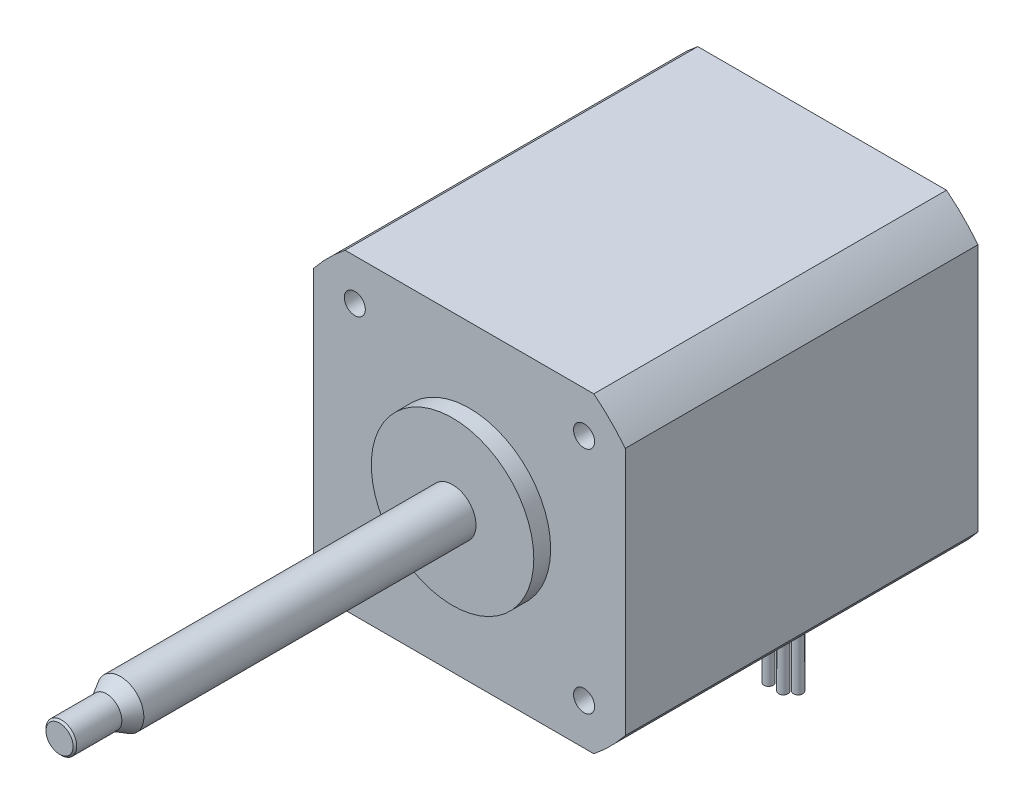
ISO-10303-21;
HEADER;
FILE_DESCRIPTION(('STEP AP214'),'2;1');
FILE_NAME('part.step','',(''),(''),'','','');
FILE_SCHEMA(('AUTOMOTIVE_DESIGN { 1 0 10303 214 1 1 1 1 }'));
ENDSEC;
DATA;
#1=APPLICATION_CONTEXT('core data for automotive mechanical design processes');
#2=APPLICATION_PROTOCOL_DEFINITION('international standard','automotive_design',2000,#1);
#3=PRODUCT_CONTEXT('',#1,'mechanical');
#4=PRODUCT('Part','Part','',(#3));
#5=PRODUCT_RELATED_PRODUCT_CATEGORY('part','',(#4));
#6=PRODUCT_DEFINITION_FORMATION('','',#4);
#7=PRODUCT_DEFINITION_CONTEXT('part definition',#1,'design');
#8=PRODUCT_DEFINITION('design','',#6,#7);
#9=PRODUCT_DEFINITION_SHAPE('','',#8);
#10=(LENGTH_UNIT() NAMED_UNIT(*) SI_UNIT(.MILLI.,.METRE.));
#11=(NAMED_UNIT(*) PLANE_ANGLE_UNIT() SI_UNIT($,.RADIAN.));
#12=(NAMED_UNIT(*) SI_UNIT($,.STERADIAN.) SOLID_ANGLE_UNIT());
#13=UNCERTAINTY_MEASURE_WITH_UNIT(LENGTH_MEASURE(1.E-05),#10,'distance_accuracy_value','');
#14=(GEOMETRIC_REPRESENTATION_CONTEXT(3) GLOBAL_UNCERTAINTY_ASSIGNED_CONTEXT((#13)) GLOBAL_UNIT_ASSIGNED_CONTEXT((#10,
#11,#12)) REPRESENTATION_CONTEXT('',''));
#15=CARTESIAN_POINT('',(0.,0.,0.));
#16=DIRECTION('',(0.,0.,1.));
#17=DIRECTION('',(1.,0.,0.));
#18=AXIS2_PLACEMENT_3D('',#15,#16,#17);
#19=CARTESIAN_POINT('',(0.,0.,55.2419509131439));
#20=DIRECTION('',(0.,0.,-0.999999999999995));
#21=DIRECTION('',(-0.421543260999066,0.906808292367399,0.));
#22=AXIS2_PLACEMENT_3D('',#19,#20,#21);
#23=CONICAL_SURFACE('',#22,2.0828,0.785398163397428);
#24=CARTESIAN_POINT('',(0.,0.,55.4919509131439));
#25=DIRECTION('',(0.,0.,-0.999999999999995));
#26=DIRECTION('',(-0.421543260999066,0.906808292367399,0.));
#27=AXIS2_PLACEMENT_3D('',#24,#25,#26);
#28=CIRCLE('',#27,1.8328);
#29=CARTESIAN_POINT('',(-0.772604488759085,1.66199823825096,55.4919509131439));
#30=VERTEX_POINT('',#29);
#31=EDGE_CURVE('E299',#30,#30,#28,.T.);
#32=ORIENTED_EDGE('',*,*,#31,.T.);
#33=EDGE_LOOP('',(#32));
#34=FACE_BOUND('',#33,.T.);
#35=CARTESIAN_POINT('',(0.,0.,55.2419509131439));
#36=DIRECTION('',(0.,0.,-0.999999999999995));
#37=DIRECTION('',(-0.421543260999066,0.906808292367399,0.));
#38=AXIS2_PLACEMENT_3D('',#35,#36,#37);
#39=CIRCLE('',#38,2.0828);
#40=CARTESIAN_POINT('',(-0.877990304008853,1.88870031134282,55.2419509131439));
#41=VERTEX_POINT('',#40);
#42=EDGE_CURVE('E25',#41,#41,#39,.T.);
#43=ORIENTED_EDGE('',*,*,#42,.F.);
#44=EDGE_LOOP('',(#43));
#45=FACE_BOUND('',#44,.T.);
#46=ADVANCED_FACE('F16',(#34,#45),#23,.T.);
#47=CARTESIAN_POINT('',(0.,0.,55.4919509131439));
#48=DIRECTION('',(0.,0.,-0.999999999999995));
#49=DIRECTION('',(-0.421543260999066,0.906808292367399,0.));
#50=AXIS2_PLACEMENT_3D('',#47,#48,#49);
#51=CYLINDRICAL_SURFACE('',#50,2.0828);
#52=ORIENTED_EDGE('',*,*,#42,.T.);
#53=EDGE_LOOP('',(#52));
#54=FACE_BOUND('',#53,.T.);
#55=CARTESIAN_POINT('',(0.,0.,49.1419509131439));
#56=DIRECTION('',(0.,0.,-0.999999999999995));
#57=DIRECTION('',(-0.421543260999066,0.906808292367399,0.));
#58=AXIS2_PLACEMENT_3D('',#55,#56,#57);
#59=CIRCLE('',#58,2.0828);
#60=CARTESIAN_POINT('',(-0.877990304008853,1.88870031134282,49.1419509131439));
#61=VERTEX_POINT('',#60);
#62=EDGE_CURVE('E315',#61,#61,#59,.T.);
#63=ORIENTED_EDGE('',*,*,#62,.F.);
#64=EDGE_LOOP('',(#63));
#65=FACE_BOUND('',#64,.T.);
#66=ADVANCED_FACE('F324',(#54,#65),#51,.T.);
#67=CARTESIAN_POINT('',(0.,0.,47.2502050211172));
#68=DIRECTION('',(0.,0.,-0.999999999999995));
#69=DIRECTION('',(-0.421543260999066,0.906808292367399,0.));
#70=AXIS2_PLACEMENT_3D('',#67,#68,#69);
#71=CONICAL_SURFACE('',#70,3.175,0.523598775598295);
#72=ORIENTED_EDGE('',*,*,#62,.T.);
#73=EDGE_LOOP('',(#72));
#74=FACE_BOUND('',#73,.T.);
#75=CARTESIAN_POINT('',(0.,0.,47.2502050211172));
#76=DIRECTION('',(0.,0.,-0.999999999999995));
#77=DIRECTION('',(-0.421543260999066,0.906808292367399,0.));
#78=AXIS2_PLACEMENT_3D('',#75,#76,#77);
#79=CIRCLE('',#78,3.175);
#80=CARTESIAN_POINT('',(-1.33839985367203,2.87911632826649,47.2502050211172));
#81=VERTEX_POINT('',#80);
#82=EDGE_CURVE('E311',#81,#81,#79,.T.);
#83=ORIENTED_EDGE('',*,*,#82,.F.);
#84=EDGE_LOOP('',(#83));
#85=FACE_BOUND('',#84,.T.);
#86=ADVANCED_FACE('F332',(#74,#85),#71,.T.);
#87=CARTESIAN_POINT('',(0.,0.,55.4919509131439));
#88=DIRECTION('',(0.,0.,-0.999999999999995));
#89=DIRECTION('',(-0.421543260999066,0.906808292367399,0.));
#90=AXIS2_PLACEMENT_3D('',#87,#88,#89);
#91=CYLINDRICAL_SURFACE('',#90,3.17500000000001);
#92=CARTESIAN_POINT('',(0.,0.,2.286));
#93=DIRECTION('',(0.,0.,1.));
#94=DIRECTION('',(1.,0.,0.));
#95=AXIS2_PLACEMENT_3D('',#92,#93,#94);
#96=CIRCLE('',#95,3.17500000000001);
#97=CARTESIAN_POINT('',(3.17500000000001,0.,2.286));
#98=VERTEX_POINT('',#97);
#99=EDGE_CURVE('E11',#98,#98,#96,.F.);
#100=ORIENTED_EDGE('',*,*,#99,.F.);
#101=EDGE_LOOP('',(#100));
#102=FACE_BOUND('',#101,.T.);
#103=ORIENTED_EDGE('',*,*,#82,.T.);
#104=EDGE_LOOP('',(#103));
#105=FACE_BOUND('',#104,.T.);
#106=ADVANCED_FACE('F337',(#102,#105),#91,.T.);
#107=CARTESIAN_POINT('',(0.772604488759085,-1.66199823825096,55.4919509131439));
#108=DIRECTION('',(0.,0.,0.999999999999995));
#109=DIRECTION('',(0.421543260999066,-0.906808292367399,0.));
#110=AXIS2_PLACEMENT_3D('',#107,#108,#109);
#111=PLANE('',#110);
#112=ORIENTED_EDGE('',*,*,#31,.F.);
#113=EDGE_LOOP('',(#112));
#114=FACE_BOUND('',#113,.T.);
#115=ADVANCED_FACE('F335',(#114),#111,.T.);
#116=CARTESIAN_POINT('',(-2.25,-17.925,-40.75));
#117=DIRECTION('',(0.,1.,0.));
#118=DIRECTION('',(0.,0.,1.));
#119=AXIS2_PLACEMENT_3D('',#116,#117,#118);
#120=PLANE('',#119);
#121=DIRECTION('',(0.,0.,-1.));
#122=VECTOR('',#121,1.);
#123=CARTESIAN_POINT('',(-2.25,-17.925,-44.25));
#124=LINE('',#123,#122);
#125=CARTESIAN_POINT('',(-2.25,-17.925,-40.75));
#126=VERTEX_POINT('',#125);
#127=CARTESIAN_POINT('',(-2.25,-17.925,-44.25));
#128=VERTEX_POINT('',#127);
#129=EDGE_CURVE('E136',#126,#128,#124,.T.);
#130=ORIENTED_EDGE('',*,*,#129,.T.);
#131=DIRECTION('',(1.,0.,0.));
#132=VECTOR('',#131,1.);
#133=CARTESIAN_POINT('',(-2.25,-17.925,-44.25));
#134=LINE('',#133,#132);
#135=CARTESIAN_POINT('',(2.25,-17.925,-44.25));
#136=VERTEX_POINT('',#135);
#137=EDGE_CURVE('E146',#128,#136,#134,.T.);
#138=ORIENTED_EDGE('',*,*,#137,.T.);
#139=DIRECTION('',(0.,0.,1.));
#140=VECTOR('',#139,1.);
#141=CARTESIAN_POINT('',(2.25,-17.925,-44.25));
#142=LINE('',#141,#140);
#143=CARTESIAN_POINT('',(2.25,-17.925,-40.75));
#144=VERTEX_POINT('',#143);
#145=EDGE_CURVE('E152',#136,#144,#142,.T.);
#146=ORIENTED_EDGE('',*,*,#145,.T.);
#147=DIRECTION('',(-1.,0.,0.));
#148=VECTOR('',#147,1.);
#149=CARTESIAN_POINT('',(-2.25,-17.925,-40.75));
#150=LINE('',#149,#148);
#151=EDGE_CURVE('E143',#144,#126,#150,.T.);
#152=ORIENTED_EDGE('',*,*,#151,.T.);
#153=EDGE_LOOP('',(#130,#138,#146,#152));
#154=FACE_BOUND('',#153,.T.);
#155=CARTESIAN_POINT('',(-1.5,-17.925,-42.));
#156=DIRECTION('',(0.,1.,0.));
#157=DIRECTION('',(0.,0.,1.));
#158=AXIS2_PLACEMENT_3D('',#155,#156,#157);
#159=CIRCLE('',#158,0.634999999999999);
#160=CARTESIAN_POINT('',(-1.5,-17.925,-41.365));
#161=VERTEX_POINT('',#160);
#162=EDGE_CURVE('E283',#161,#161,#159,.F.);
#163=ORIENTED_EDGE('',*,*,#162,.F.);
#164=EDGE_LOOP('',(#163));
#165=FACE_BOUND('',#164,.T.);
#166=CARTESIAN_POINT('',(0.500000000000003,-17.925,-42.));
#167=DIRECTION('',(0.,1.,0.));
#168=DIRECTION('',(0.,0.,1.));
#169=AXIS2_PLACEMENT_3D('',#166,#167,#168);
#170=CIRCLE('',#169,0.634999999999999);
#171=CARTESIAN_POINT('',(0.500000000000003,-17.925,-41.365));
#172=VERTEX_POINT('',#171);
#173=EDGE_CURVE('E287',#172,#172,#170,.F.);
#174=ORIENTED_EDGE('',*,*,#173,.F.);
#175=EDGE_LOOP('',(#174));
#176=FACE_BOUND('',#175,.T.);
#177=CARTESIAN_POINT('',(-0.499999999999996,-17.925,-43.));
#178=DIRECTION('',(0.,1.,0.));
#179=DIRECTION('',(0.,0.,1.));
#180=AXIS2_PLACEMENT_3D('',#177,#178,#179);
#181=CIRCLE('',#180,0.634999999999998);
#182=CARTESIAN_POINT('',(-0.499999999999996,-17.925,-42.365));
#183=VERTEX_POINT('',#182);
#184=EDGE_CURVE('E291',#183,#183,#181,.F.);
#185=ORIENTED_EDGE('',*,*,#184,.F.);
#186=EDGE_LOOP('',(#185));
#187=FACE_BOUND('',#186,.T.);
#188=CARTESIAN_POINT('',(1.5,-17.925,-43.));
#189=DIRECTION('',(0.,1.,0.));
#190=DIRECTION('',(0.,0.,1.));
#191=AXIS2_PLACEMENT_3D('',#188,#189,#190);
#192=CIRCLE('',#191,0.634999999999998);
#193=CARTESIAN_POINT('',(1.5,-17.925,-42.365));
#194=VERTEX_POINT('',#193);
#195=EDGE_CURVE('E295',#194,#194,#192,.F.);
#196=ORIENTED_EDGE('',*,*,#195,.F.);
#197=EDGE_LOOP('',(#196));
#198=FACE_BOUND('',#197,.T.);
#199=ADVANCED_FACE('F154',(#154,#165,#176,#187,#198),#120,.F.);
#200=CARTESIAN_POINT('',(-21.1,-21.1,0.));
#201=DIRECTION('',(0.,0.,1.));
#202=DIRECTION('',(1.,0.,0.));
#203=AXIS2_PLACEMENT_3D('',#200,#201,#202);
#204=PLANE('',#203);
#205=CARTESIAN_POINT('',(-15.52,-15.52,0.));
#206=DIRECTION('',(0.,0.,1.));
#207=DIRECTION('',(1.,0.,0.));
#208=AXIS2_PLACEMENT_3D('',#205,#206,#207);
#209=CIRCLE('',#208,1.4224);
#210=CARTESIAN_POINT('',(-14.0976,-15.52,0.));
#211=VERTEX_POINT('',#210);
#212=EDGE_CURVE('E840',#211,#211,#209,.T.);
#213=ORIENTED_EDGE('',*,*,#212,.F.);
#214=EDGE_LOOP('',(#213));
#215=FACE_BOUND('',#214,.T.);
#216=CARTESIAN_POINT('',(15.52,-15.52,0.));
#217=DIRECTION('',(0.,0.,1.));
#218=DIRECTION('',(1.,0.,0.));
#219=AXIS2_PLACEMENT_3D('',#216,#217,#218);
#220=CIRCLE('',#219,1.4224);
#221=CARTESIAN_POINT('',(16.9424,-15.52,0.));
#222=VERTEX_POINT('',#221);
#223=EDGE_CURVE('E847',#222,#222,#220,.T.);
#224=ORIENTED_EDGE('',*,*,#223,.F.);
#225=EDGE_LOOP('',(#224));
#226=FACE_BOUND('',#225,.T.);
#227=CARTESIAN_POINT('',(15.52,15.52,0.));
#228=DIRECTION('',(0.,0.,1.));
#229=DIRECTION('',(1.,0.,0.));
#230=AXIS2_PLACEMENT_3D('',#227,#228,#229);
#231=CIRCLE('',#230,1.4224);
#232=CARTESIAN_POINT('',(16.9424,15.52,0.));
#233=VERTEX_POINT('',#232);
#234=EDGE_CURVE('E766',#233,#233,#231,.T.);
#235=ORIENTED_EDGE('',*,*,#234,.F.);
#236=EDGE_LOOP('',(#235));
#237=FACE_BOUND('',#236,.T.);
#238=CARTESIAN_POINT('',(-15.52,15.52,0.));
#239=DIRECTION('',(0.,0.,1.));
#240=DIRECTION('',(1.,0.,0.));
#241=AXIS2_PLACEMENT_3D('',#238,#239,#240);
#242=CIRCLE('',#241,1.4224);
#243=CARTESIAN_POINT('',(-14.0976,15.52,0.));
#244=VERTEX_POINT('',#243);
#245=EDGE_CURVE('E754',#244,#244,#242,.T.);
#246=ORIENTED_EDGE('',*,*,#245,.F.);
#247=EDGE_LOOP('',(#246));
#248=FACE_BOUND('',#247,.T.);
#249=CARTESIAN_POINT('',(-0.113980167868195,-0.113980167868181,0.));
#250=DIRECTION('',(0.,0.,-1.));
#251=DIRECTION('',(-1.,0.,0.));
#252=AXIS2_PLACEMENT_3D('',#249,#250,#251);
#253=CIRCLE('',#252,26.8351);
#254=CARTESIAN_POINT('',(-16.8385,-21.1,0.));
#255=VERTEX_POINT('',#254);
#256=CARTESIAN_POINT('',(-21.1,-16.8385,0.));
#257=VERTEX_POINT('',#256);
#258=EDGE_CURVE('E200',#255,#257,#253,.T.);
#259=ORIENTED_EDGE('',*,*,#258,.F.);
#260=DIRECTION('',(1.,0.,0.));
#261=VECTOR('',#260,1.);
#262=CARTESIAN_POINT('',(-21.1,-21.1,0.));
#263=LINE('',#262,#261);
#264=CARTESIAN_POINT('',(16.8385,-21.1,0.));
#265=VERTEX_POINT('',#264);
#266=EDGE_CURVE('E259',#255,#265,#263,.T.);
#267=ORIENTED_EDGE('',*,*,#266,.T.);
#268=CARTESIAN_POINT('',(0.113980167868195,-0.113980167868181,0.));
#269=DIRECTION('',(0.,0.,-1.));
#270=DIRECTION('',(1.,0.,0.));
#271=AXIS2_PLACEMENT_3D('',#268,#269,#270);
#272=CIRCLE('',#271,26.8351);
#273=CARTESIAN_POINT('',(21.1,-16.8385,0.));
#274=VERTEX_POINT('',#273);
#275=EDGE_CURVE('E210',#274,#265,#272,.T.);
#276=ORIENTED_EDGE('',*,*,#275,.F.);
#277=DIRECTION('',(0.,1.,0.));
#278=VECTOR('',#277,1.);
#279=CARTESIAN_POINT('',(21.1,21.1,0.));
#280=LINE('',#279,#278);
#281=CARTESIAN_POINT('',(21.1,16.8385,0.));
#282=VERTEX_POINT('',#281);
#283=EDGE_CURVE('E262',#274,#282,#280,.T.);
#284=ORIENTED_EDGE('',*,*,#283,.T.);
#285=CARTESIAN_POINT('',(0.113980167868195,0.113980167868181,0.));
#286=DIRECTION('',(0.,0.,-1.));
#287=DIRECTION('',(-1.,0.,0.));
#288=AXIS2_PLACEMENT_3D('',#285,#286,#287);
#289=CIRCLE('',#288,26.8351);
#290=CARTESIAN_POINT('',(16.8385,21.1,0.));
#291=VERTEX_POINT('',#290);
#292=EDGE_CURVE('E238',#291,#282,#289,.T.);
#293=ORIENTED_EDGE('',*,*,#292,.F.);
#294=DIRECTION('',(-1.,0.,0.));
#295=VECTOR('',#294,1.);
#296=CARTESIAN_POINT('',(-21.1,21.1,0.));
#297=LINE('',#296,#295);
#298=CARTESIAN_POINT('',(-16.8385,21.1,0.));
#299=VERTEX_POINT('',#298);
#300=EDGE_CURVE('E265',#291,#299,#297,.T.);
#301=ORIENTED_EDGE('',*,*,#300,.T.);
#302=CARTESIAN_POINT('',(-0.113980167868195,0.113980167868181,0.));
#303=DIRECTION('',(0.,0.,-1.));
#304=DIRECTION('',(1.,0.,0.));
#305=AXIS2_PLACEMENT_3D('',#302,#303,#304);
#306=CIRCLE('',#305,26.8351);
#307=CARTESIAN_POINT('',(-21.1,16.8385,0.));
#308=VERTEX_POINT('',#307);
#309=EDGE_CURVE('E224',#308,#299,#306,.T.);
#310=ORIENTED_EDGE('',*,*,#309,.F.);
#311=DIRECTION('',(0.,-1.,0.));
#312=VECTOR('',#311,1.);
#313=CARTESIAN_POINT('',(-21.1,21.1,0.));
#314=LINE('',#313,#312);
#315=EDGE_CURVE('E253',#308,#257,#314,.T.);
#316=ORIENTED_EDGE('',*,*,#315,.T.);
#317=EDGE_LOOP('',(#259,#267,#276,#284,#293,#301,#310,#316));
#318=FACE_BOUND('',#317,.T.);
#319=CARTESIAN_POINT('',(0.,0.,0.));
#320=DIRECTION('',(0.,0.,1.));
#321=DIRECTION('',(1.,0.,0.));
#322=AXIS2_PLACEMENT_3D('',#319,#320,#321);
#323=CIRCLE('',#322,10.9982);
#324=CARTESIAN_POINT('',(10.9982,0.,0.));
#325=VERTEX_POINT('',#324);
#326=EDGE_CURVE('E187',#325,#325,#323,.T.);
#327=ORIENTED_EDGE('',*,*,#326,.F.);
#328=EDGE_LOOP('',(#327));
#329=FACE_BOUND('',#328,.T.);
#330=ADVANCED_FACE('F342',(#215,#226,#237,#248,#318,#329),#204,.T.);
#331=CARTESIAN_POINT('',(-21.1,21.1,-47.75));
#332=DIRECTION('',(-1.,0.,0.));
#333=DIRECTION('',(0.,-1.,0.));
#334=AXIS2_PLACEMENT_3D('',#331,#332,#333);
#335=PLANE('',#334);
#336=DIRECTION('',(0.,0.,1.));
#337=VECTOR('',#336,1.);
#338=CARTESIAN_POINT('',(-21.1,-16.8385,-47.75));
#339=LINE('',#338,#337);
#340=CARTESIAN_POINT('',(-21.1,-16.8385,-47.75));
#341=VERTEX_POINT('',#340);
#342=EDGE_CURVE('E207',#341,#257,#339,.T.);
#343=ORIENTED_EDGE('',*,*,#342,.T.);
#344=ORIENTED_EDGE('',*,*,#315,.F.);
#345=DIRECTION('',(0.,0.,1.));
#346=VECTOR('',#345,1.);
#347=CARTESIAN_POINT('',(-21.1,16.8385,-47.75));
#348=LINE('',#347,#346);
#349=CARTESIAN_POINT('',(-21.1,16.8385,-47.75));
#350=VERTEX_POINT('',#349);
#351=EDGE_CURVE('E235',#350,#308,#348,.T.);
#352=ORIENTED_EDGE('',*,*,#351,.F.);
#353=DIRECTION('',(0.,-1.,0.));
#354=VECTOR('',#353,1.);
#355=CARTESIAN_POINT('',(-21.1,21.1,-47.75));
#356=LINE('',#355,#354);
#357=EDGE_CURVE('E269',#350,#341,#356,.T.);
#358=ORIENTED_EDGE('',*,*,#357,.T.);
#359=EDGE_LOOP('',(#343,#344,#352,#358));
#360=FACE_BOUND('',#359,.T.);
#361=ADVANCED_FACE('F349',(#360),#335,.T.);
#362=CARTESIAN_POINT('',(-21.1,21.1,-47.75));
#363=DIRECTION('',(0.,1.,0.));
#364=DIRECTION('',(0.,0.,1.));
#365=AXIS2_PLACEMENT_3D('',#362,#363,#364);
#366=PLANE('',#365);
#367=DIRECTION('',(0.,0.,1.));
#368=VECTOR('',#367,1.);
#369=CARTESIAN_POINT('',(-16.8385,21.1,-47.75));
#370=LINE('',#369,#368);
#371=CARTESIAN_POINT('',(-16.8385,21.1,-47.75));
#372=VERTEX_POINT('',#371);
#373=EDGE_CURVE('E234',#372,#299,#370,.T.);
#374=ORIENTED_EDGE('',*,*,#373,.T.);
#375=ORIENTED_EDGE('',*,*,#300,.F.);
#376=DIRECTION('',(0.,0.,1.));
#377=VECTOR('',#376,1.);
#378=CARTESIAN_POINT('',(16.8385,21.1,-47.75));
#379=LINE('',#378,#377);
#380=CARTESIAN_POINT('',(16.8385,21.1,-47.75));
#381=VERTEX_POINT('',#380);
#382=EDGE_CURVE('E248',#381,#291,#379,.T.);
#383=ORIENTED_EDGE('',*,*,#382,.F.);
#384=DIRECTION('',(-1.,0.,0.));
#385=VECTOR('',#384,1.);
#386=CARTESIAN_POINT('',(-21.1,21.1,-47.75));
#387=LINE('',#386,#385);
#388=EDGE_CURVE('E279',#381,#372,#387,.T.);
#389=ORIENTED_EDGE('',*,*,#388,.T.);
#390=EDGE_LOOP('',(#374,#375,#383,#389));
#391=FACE_BOUND('',#390,.T.);
#392=ADVANCED_FACE('F490',(#391),#366,.T.);
#393=CARTESIAN_POINT('',(21.1,21.1,-47.75));
#394=DIRECTION('',(1.,0.,0.));
#395=DIRECTION('',(0.,1.,0.));
#396=AXIS2_PLACEMENT_3D('',#393,#394,#395);
#397=PLANE('',#396);
#398=DIRECTION('',(0.,0.,1.));
#399=VECTOR('',#398,1.);
#400=CARTESIAN_POINT('',(21.1,-16.8385,-47.75));
#401=LINE('',#400,#399);
#402=CARTESIAN_POINT('',(21.1,-16.8385,-47.75));
#403=VERTEX_POINT('',#402);
#404=EDGE_CURVE('E221',#403,#274,#401,.T.);
#405=ORIENTED_EDGE('',*,*,#404,.F.);
#406=DIRECTION('',(0.,1.,0.));
#407=VECTOR('',#406,1.);
#408=CARTESIAN_POINT('',(21.1,21.1,-47.75));
#409=LINE('',#408,#407);
#410=CARTESIAN_POINT('',(21.1,16.8385,-47.75));
#411=VERTEX_POINT('',#410);
#412=EDGE_CURVE('E276',#403,#411,#409,.T.);
#413=ORIENTED_EDGE('',*,*,#412,.T.);
#414=DIRECTION('',(0.,0.,1.));
#415=VECTOR('',#414,1.);
#416=CARTESIAN_POINT('',(21.1,16.8385,-47.75));
#417=LINE('',#416,#415);
#418=EDGE_CURVE('E249',#411,#282,#417,.T.);
#419=ORIENTED_EDGE('',*,*,#418,.T.);
#420=ORIENTED_EDGE('',*,*,#283,.F.);
#421=EDGE_LOOP('',(#405,#413,#419,#420));
#422=FACE_BOUND('',#421,.T.);
#423=ADVANCED_FACE('F484',(#422),#397,.T.);
#424=CARTESIAN_POINT('',(-21.1,-21.1,-47.75));
#425=DIRECTION('',(0.,-1.,0.));
#426=DIRECTION('',(0.,0.,-1.));
#427=AXIS2_PLACEMENT_3D('',#424,#425,#426);
#428=PLANE('',#427);
#429=DIRECTION('',(0.,0.,-1.));
#430=VECTOR('',#429,1.);
#431=CARTESIAN_POINT('',(-2.25,-21.1,-44.25));
#432=LINE('',#431,#430);
#433=CARTESIAN_POINT('',(-2.25,-21.1,-40.75));
#434=VERTEX_POINT('',#433);
#435=CARTESIAN_POINT('',(-2.25,-21.1,-44.25));
#436=VERTEX_POINT('',#435);
#437=EDGE_CURVE('E37',#434,#436,#432,.T.);
#438=ORIENTED_EDGE('',*,*,#437,.F.);
#439=DIRECTION('',(-1.,0.,0.));
#440=VECTOR('',#439,1.);
#441=CARTESIAN_POINT('',(-2.25,-21.1,-40.75));
#442=LINE('',#441,#440);
#443=CARTESIAN_POINT('',(2.25,-21.1,-40.75));
#444=VERTEX_POINT('',#443);
#445=EDGE_CURVE('E158',#444,#434,#442,.T.);
#446=ORIENTED_EDGE('',*,*,#445,.F.);
#447=DIRECTION('',(0.,0.,1.));
#448=VECTOR('',#447,1.);
#449=CARTESIAN_POINT('',(2.25,-21.1,-44.25));
#450=LINE('',#449,#448);
#451=CARTESIAN_POINT('',(2.25,-21.1,-44.25));
#452=VERTEX_POINT('',#451);
#453=EDGE_CURVE('E166',#452,#444,#450,.T.);
#454=ORIENTED_EDGE('',*,*,#453,.F.);
#455=DIRECTION('',(1.,0.,0.));
#456=VECTOR('',#455,1.);
#457=CARTESIAN_POINT('',(-2.25,-21.1,-44.25));
#458=LINE('',#457,#456);
#459=EDGE_CURVE('E178',#436,#452,#458,.T.);
#460=ORIENTED_EDGE('',*,*,#459,.F.);
#461=EDGE_LOOP('',(#438,#446,#454,#460));
#462=FACE_BOUND('',#461,.T.);
#463=DIRECTION('',(0.,0.,1.));
#464=VECTOR('',#463,1.);
#465=CARTESIAN_POINT('',(-16.8385,-21.1,-47.75));
#466=LINE('',#465,#464);
#467=CARTESIAN_POINT('',(-16.8385,-21.1,-47.75));
#468=VERTEX_POINT('',#467);
#469=EDGE_CURVE('E47',#468,#255,#466,.T.);
#470=ORIENTED_EDGE('',*,*,#469,.F.);
#471=DIRECTION('',(1.,0.,0.));
#472=VECTOR('',#471,1.);
#473=CARTESIAN_POINT('',(-21.1,-21.1,-47.75));
#474=LINE('',#473,#472);
#475=CARTESIAN_POINT('',(16.8385,-21.1,-47.75));
#476=VERTEX_POINT('',#475);
#477=EDGE_CURVE('E273',#468,#476,#474,.T.);
#478=ORIENTED_EDGE('',*,*,#477,.T.);
#479=DIRECTION('',(0.,0.,1.));
#480=VECTOR('',#479,1.);
#481=CARTESIAN_POINT('',(16.8385,-21.1,-47.75));
#482=LINE('',#481,#480);
#483=EDGE_CURVE('E220',#476,#265,#482,.T.);
#484=ORIENTED_EDGE('',*,*,#483,.T.);
#485=ORIENTED_EDGE('',*,*,#266,.F.);
#486=EDGE_LOOP('',(#470,#478,#484,#485));
#487=FACE_BOUND('',#486,.T.);
#488=ADVANCED_FACE('F489',(#462,#487),#428,.T.);
#489=CARTESIAN_POINT('',(-21.1,-21.1,-47.75));
#490=DIRECTION('',(0.,0.,1.));
#491=DIRECTION('',(1.,0.,0.));
#492=AXIS2_PLACEMENT_3D('',#489,#490,#491);
#493=PLANE('',#492);
#494=CARTESIAN_POINT('',(0.,0.,-47.75));
#495=DIRECTION('',(0.,0.,1.));
#496=DIRECTION('',(1.,0.,0.));
#497=AXIS2_PLACEMENT_3D('',#494,#495,#496);
#498=CIRCLE('',#497,3.17500000000001);
#499=CARTESIAN_POINT('',(3.17500000000001,0.,-47.75));
#500=VERTEX_POINT('',#499);
#501=EDGE_CURVE('E19',#500,#500,#498,.F.);
#502=ORIENTED_EDGE('',*,*,#501,.F.);
#503=EDGE_LOOP('',(#502));
#504=FACE_BOUND('',#503,.T.);
#505=ORIENTED_EDGE('',*,*,#477,.F.);
#506=CARTESIAN_POINT('',(-0.113980167868195,-0.113980167868181,-47.75));
#507=DIRECTION('',(0.,0.,-1.));
#508=DIRECTION('',(-1.,0.,0.));
#509=AXIS2_PLACEMENT_3D('',#506,#507,#508);
#510=CIRCLE('',#509,26.8351);
#511=EDGE_CURVE('E203',#468,#341,#510,.T.);
#512=ORIENTED_EDGE('',*,*,#511,.T.);
#513=ORIENTED_EDGE('',*,*,#357,.F.);
#514=CARTESIAN_POINT('',(-0.113980167868195,0.113980167868181,-47.75));
#515=DIRECTION('',(0.,0.,-1.));
#516=DIRECTION('',(1.,0.,0.));
#517=AXIS2_PLACEMENT_3D('',#514,#515,#516);
#518=CIRCLE('',#517,26.8351);
#519=EDGE_CURVE('E230',#350,#372,#518,.T.);
#520=ORIENTED_EDGE('',*,*,#519,.T.);
#521=ORIENTED_EDGE('',*,*,#388,.F.);
#522=CARTESIAN_POINT('',(0.113980167868195,0.113980167868181,-47.75));
#523=DIRECTION('',(0.,0.,-1.));
#524=DIRECTION('',(-1.,0.,0.));
#525=AXIS2_PLACEMENT_3D('',#522,#523,#524);
#526=CIRCLE('',#525,26.8351);
#527=EDGE_CURVE('E244',#381,#411,#526,.T.);
#528=ORIENTED_EDGE('',*,*,#527,.T.);
#529=ORIENTED_EDGE('',*,*,#412,.F.);
#530=CARTESIAN_POINT('',(0.113980167868195,-0.113980167868181,-47.75));
#531=DIRECTION('',(0.,0.,-1.));
#532=DIRECTION('',(1.,0.,0.));
#533=AXIS2_PLACEMENT_3D('',#530,#531,#532);
#534=CIRCLE('',#533,26.8351);
#535=EDGE_CURVE('E217',#403,#476,#534,.T.);
#536=ORIENTED_EDGE('',*,*,#535,.T.);
#537=EDGE_LOOP('',(#505,#512,#513,#520,#521,#528,#529,#536));
#538=FACE_BOUND('',#537,.T.);
#539=ADVANCED_FACE('F610',(#504,#538),#493,.F.);
#540=CARTESIAN_POINT('',(0.113980167868195,0.113980167868181,-47.75));
#541=DIRECTION('',(0.,0.,1.));
#542=DIRECTION('',(1.,0.,0.));
#543=AXIS2_PLACEMENT_3D('',#540,#541,#542);
#544=CYLINDRICAL_SURFACE('',#543,26.8351);
#545=ORIENTED_EDGE('',*,*,#292,.T.);
#546=ORIENTED_EDGE('',*,*,#418,.F.);
#547=ORIENTED_EDGE('',*,*,#527,.F.);
#548=ORIENTED_EDGE('',*,*,#382,.T.);
#549=EDGE_LOOP('',(#545,#546,#547,#548));
#550=FACE_BOUND('',#549,.T.);
#551=ADVANCED_FACE('F617',(#550),#544,.T.);
#552=CARTESIAN_POINT('',(-0.113980167868195,0.113980167868181,-47.75));
#553=DIRECTION('',(0.,0.,1.));
#554=DIRECTION('',(1.,0.,0.));
#555=AXIS2_PLACEMENT_3D('',#552,#553,#554);
#556=CYLINDRICAL_SURFACE('',#555,26.8351);
#557=ORIENTED_EDGE('',*,*,#309,.T.);
#558=ORIENTED_EDGE('',*,*,#373,.F.);
#559=ORIENTED_EDGE('',*,*,#519,.F.);
#560=ORIENTED_EDGE('',*,*,#351,.T.);
#561=EDGE_LOOP('',(#557,#558,#559,#560));
#562=FACE_BOUND('',#561,.T.);
#563=ADVANCED_FACE('F622',(#562),#556,.T.);
#564=CARTESIAN_POINT('',(0.113980167868195,-0.113980167868181,-47.75));
#565=DIRECTION('',(0.,0.,1.));
#566=DIRECTION('',(1.,0.,0.));
#567=AXIS2_PLACEMENT_3D('',#564,#565,#566);
#568=CYLINDRICAL_SURFACE('',#567,26.8351);
#569=ORIENTED_EDGE('',*,*,#275,.T.);
#570=ORIENTED_EDGE('',*,*,#483,.F.);
#571=ORIENTED_EDGE('',*,*,#535,.F.);
#572=ORIENTED_EDGE('',*,*,#404,.T.);
#573=EDGE_LOOP('',(#569,#570,#571,#572));
#574=FACE_BOUND('',#573,.T.);
#575=ADVANCED_FACE('F628',(#574),#568,.T.);
#576=CARTESIAN_POINT('',(-0.113980167868195,-0.113980167868181,-47.75));
#577=DIRECTION('',(0.,0.,1.));
#578=DIRECTION('',(1.,0.,0.));
#579=AXIS2_PLACEMENT_3D('',#576,#577,#578);
#580=CYLINDRICAL_SURFACE('',#579,26.8351);
#581=ORIENTED_EDGE('',*,*,#258,.T.);
#582=ORIENTED_EDGE('',*,*,#342,.F.);
#583=ORIENTED_EDGE('',*,*,#511,.F.);
#584=ORIENTED_EDGE('',*,*,#469,.T.);
#585=EDGE_LOOP('',(#581,#582,#583,#584));
#586=FACE_BOUND('',#585,.T.);
#587=ADVANCED_FACE('F634',(#586),#580,.T.);
#588=CARTESIAN_POINT('',(0.,0.,2.286));
#589=DIRECTION('',(0.,0.,1.));
#590=DIRECTION('',(1.,0.,0.));
#591=AXIS2_PLACEMENT_3D('',#588,#589,#590);
#592=PLANE('',#591);
#593=ORIENTED_EDGE('',*,*,#99,.T.);
#594=EDGE_LOOP('',(#593));
#595=FACE_BOUND('',#594,.T.);
#596=CARTESIAN_POINT('',(0.,0.,2.286));
#597=DIRECTION('',(0.,0.,1.));
#598=DIRECTION('',(1.,0.,0.));
#599=AXIS2_PLACEMENT_3D('',#596,#597,#598);
#600=CIRCLE('',#599,10.9982);
#601=CARTESIAN_POINT('',(10.9982,0.,2.286));
#602=VERTEX_POINT('',#601);
#603=EDGE_CURVE('E196',#602,#602,#600,.T.);
#604=ORIENTED_EDGE('',*,*,#603,.T.);
#605=EDGE_LOOP('',(#604));
#606=FACE_BOUND('',#605,.T.);
#607=ADVANCED_FACE('F526',(#595,#606),#592,.T.);
#608=CARTESIAN_POINT('',(0.,0.,2.286));
#609=DIRECTION('',(0.,0.,-1.));
#610=DIRECTION('',(-1.,0.,0.));
#611=AXIS2_PLACEMENT_3D('',#608,#609,#610);
#612=CYLINDRICAL_SURFACE('',#611,10.9982);
#613=ORIENTED_EDGE('',*,*,#603,.F.);
#614=EDGE_LOOP('',(#613));
#615=FACE_BOUND('',#614,.T.);
#616=ORIENTED_EDGE('',*,*,#326,.T.);
#617=EDGE_LOOP('',(#616));
#618=FACE_BOUND('',#617,.T.);
#619=ADVANCED_FACE('F501',(#615,#618),#612,.T.);
#620=CARTESIAN_POINT('',(-2.25,-17.925,-44.25));
#621=DIRECTION('',(-1.,0.,0.));
#622=DIRECTION('',(0.,0.,1.));
#623=AXIS2_PLACEMENT_3D('',#620,#621,#622);
#624=PLANE('',#623);
#625=ORIENTED_EDGE('',*,*,#437,.T.);
#626=DIRECTION('',(0.,-1.,0.));
#627=VECTOR('',#626,1.);
#628=CARTESIAN_POINT('',(-2.25,-17.925,-44.25));
#629=LINE('',#628,#627);
#630=EDGE_CURVE('E132',#128,#436,#629,.T.);
#631=ORIENTED_EDGE('',*,*,#630,.F.);
#632=ORIENTED_EDGE('',*,*,#129,.F.);
#633=DIRECTION('',(0.,-1.,0.));
#634=VECTOR('',#633,1.);
#635=CARTESIAN_POINT('',(-2.25,-17.925,-40.75));
#636=LINE('',#635,#634);
#637=EDGE_CURVE('E184',#126,#434,#636,.T.);
#638=ORIENTED_EDGE('',*,*,#637,.T.);
#639=EDGE_LOOP('',(#625,#631,#632,#638));
#640=FACE_BOUND('',#639,.T.);
#641=ADVANCED_FACE('F134',(#640),#624,.F.);
#642=CARTESIAN_POINT('',(-2.25,-17.925,-40.75));
#643=DIRECTION('',(0.,0.,1.));
#644=DIRECTION('',(1.,0.,0.));
#645=AXIS2_PLACEMENT_3D('',#642,#643,#644);
#646=PLANE('',#645);
#647=ORIENTED_EDGE('',*,*,#445,.T.);
#648=ORIENTED_EDGE('',*,*,#637,.F.);
#649=ORIENTED_EDGE('',*,*,#151,.F.);
#650=DIRECTION('',(0.,-1.,0.));
#651=VECTOR('',#650,1.);
#652=CARTESIAN_POINT('',(2.25,-17.925,-40.75));
#653=LINE('',#652,#651);
#654=EDGE_CURVE('E188',#144,#444,#653,.T.);
#655=ORIENTED_EDGE('',*,*,#654,.T.);
#656=EDGE_LOOP('',(#647,#648,#649,#655));
#657=FACE_BOUND('',#656,.T.);
#658=ADVANCED_FACE('F470',(#657),#646,.F.);
#659=CARTESIAN_POINT('',(2.25,-17.925,-44.25));
#660=DIRECTION('',(1.,0.,0.));
#661=DIRECTION('',(0.,0.,-1.));
#662=AXIS2_PLACEMENT_3D('',#659,#660,#661);
#663=PLANE('',#662);
#664=ORIENTED_EDGE('',*,*,#453,.T.);
#665=ORIENTED_EDGE('',*,*,#654,.F.);
#666=ORIENTED_EDGE('',*,*,#145,.F.);
#667=DIRECTION('',(0.,-1.,0.));
#668=VECTOR('',#667,1.);
#669=CARTESIAN_POINT('',(2.25,-17.925,-44.25));
#670=LINE('',#669,#668);
#671=EDGE_CURVE('E142',#136,#452,#670,.T.);
#672=ORIENTED_EDGE('',*,*,#671,.T.);
#673=EDGE_LOOP('',(#664,#665,#666,#672));
#674=FACE_BOUND('',#673,.T.);
#675=ADVANCED_FACE('F475',(#674),#663,.F.);
#676=CARTESIAN_POINT('',(-2.25,-17.925,-44.25));
#677=DIRECTION('',(0.,0.,-1.));
#678=DIRECTION('',(-1.,0.,0.));
#679=AXIS2_PLACEMENT_3D('',#676,#677,#678);
#680=PLANE('',#679);
#681=ORIENTED_EDGE('',*,*,#459,.T.);
#682=ORIENTED_EDGE('',*,*,#671,.F.);
#683=ORIENTED_EDGE('',*,*,#137,.F.);
#684=ORIENTED_EDGE('',*,*,#630,.T.);
#685=EDGE_LOOP('',(#681,#682,#683,#684));
#686=FACE_BOUND('',#685,.T.);
#687=ADVANCED_FACE('F147',(#686),#680,.F.);
#688=CARTESIAN_POINT('',(-1.5,-42.925,-42.));
#689=DIRECTION('',(0.,1.,0.));
#690=DIRECTION('',(0.,0.,1.));
#691=AXIS2_PLACEMENT_3D('',#688,#689,#690);
#692=CYLINDRICAL_SURFACE('',#691,0.634999999999999);
#693=CARTESIAN_POINT('',(-1.5,-42.925,-42.));
#694=DIRECTION('',(0.,-1.,0.));
#695=DIRECTION('',(0.,0.,-1.));
#696=AXIS2_PLACEMENT_3D('',#693,#694,#695);
#697=CIRCLE('',#696,0.634999999999999);
#698=CARTESIAN_POINT('',(-1.5,-42.925,-42.635));
#699=VERTEX_POINT('',#698);
#700=EDGE_CURVE('E169',#699,#699,#697,.T.);
#701=ORIENTED_EDGE('',*,*,#700,.F.);
#702=EDGE_LOOP('',(#701));
#703=FACE_BOUND('',#702,.T.);
#704=ORIENTED_EDGE('',*,*,#162,.T.);
#705=EDGE_LOOP('',(#704));
#706=FACE_BOUND('',#705,.T.);
#707=ADVANCED_FACE('F572',(#703,#706),#692,.T.);
#708=CARTESIAN_POINT('',(-1.5,-42.925,-42.));
#709=DIRECTION('',(0.,-1.,0.));
#710=DIRECTION('',(0.,0.,-1.));
#711=AXIS2_PLACEMENT_3D('',#708,#709,#710);
#712=PLANE('',#711);
#713=ORIENTED_EDGE('',*,*,#700,.T.);
#714=EDGE_LOOP('',(#713));
#715=FACE_BOUND('',#714,.T.);
#716=ADVANCED_FACE('F565',(#715),#712,.T.);
#717=CARTESIAN_POINT('',(0.500000000000003,-42.925,-42.));
#718=DIRECTION('',(0.,1.,0.));
#719=DIRECTION('',(0.,0.,1.));
#720=AXIS2_PLACEMENT_3D('',#717,#718,#719);
#721=CYLINDRICAL_SURFACE('',#720,0.634999999999999);
#722=CARTESIAN_POINT('',(0.500000000000003,-42.925,-42.));
#723=DIRECTION('',(0.,-1.,0.));
#724=DIRECTION('',(0.,0.,-1.));
#725=AXIS2_PLACEMENT_3D('',#722,#723,#724);
#726=CIRCLE('',#725,0.634999999999999);
#727=CARTESIAN_POINT('',(0.500000000000003,-42.925,-42.635));
#728=VERTEX_POINT('',#727);
#729=EDGE_CURVE('E797',#728,#728,#726,.T.);
#730=ORIENTED_EDGE('',*,*,#729,.F.);
#731=EDGE_LOOP('',(#730));
#732=FACE_BOUND('',#731,.T.);
#733=ORIENTED_EDGE('',*,*,#173,.T.);
#734=EDGE_LOOP('',(#733));
#735=FACE_BOUND('',#734,.T.);
#736=ADVANCED_FACE('F557',(#732,#735),#721,.T.);
#737=CARTESIAN_POINT('',(0.500000000000003,-42.925,-42.));
#738=DIRECTION('',(0.,-1.,0.));
#739=DIRECTION('',(0.,0.,-1.));
#740=AXIS2_PLACEMENT_3D('',#737,#738,#739);
#741=PLANE('',#740);
#742=ORIENTED_EDGE('',*,*,#729,.T.);
#743=EDGE_LOOP('',(#742));
#744=FACE_BOUND('',#743,.T.);
#745=ADVANCED_FACE('F549',(#744),#741,.T.);
#746=CARTESIAN_POINT('',(-0.499999999999996,-42.925,-43.));
#747=DIRECTION('',(0.,1.,0.));
#748=DIRECTION('',(0.,0.,1.));
#749=AXIS2_PLACEMENT_3D('',#746,#747,#748);
#750=CYLINDRICAL_SURFACE('',#749,0.634999999999998);
#751=CARTESIAN_POINT('',(-0.499999999999996,-42.925,-43.));
#752=DIRECTION('',(0.,-1.,0.));
#753=DIRECTION('',(0.,0.,-1.));
#754=AXIS2_PLACEMENT_3D('',#751,#752,#753);
#755=CIRCLE('',#754,0.634999999999998);
#756=CARTESIAN_POINT('',(-0.499999999999996,-42.925,-43.635));
#757=VERTEX_POINT('',#756);
#758=EDGE_CURVE('E801',#757,#757,#755,.T.);
#759=ORIENTED_EDGE('',*,*,#758,.F.);
#760=EDGE_LOOP('',(#759));
#761=FACE_BOUND('',#760,.T.);
#762=ORIENTED_EDGE('',*,*,#184,.T.);
#763=EDGE_LOOP('',(#762));
#764=FACE_BOUND('',#763,.T.);
#765=ADVANCED_FACE('F543',(#761,#764),#750,.T.);
#766=CARTESIAN_POINT('',(-0.499999999999996,-42.925,-43.));
#767=DIRECTION('',(0.,-1.,0.));
#768=DIRECTION('',(0.,0.,-1.));
#769=AXIS2_PLACEMENT_3D('',#766,#767,#768);
#770=PLANE('',#769);
#771=ORIENTED_EDGE('',*,*,#758,.T.);
#772=EDGE_LOOP('',(#771));
#773=FACE_BOUND('',#772,.T.);
#774=ADVANCED_FACE('F534',(#773),#770,.T.);
#775=CARTESIAN_POINT('',(1.5,-42.925,-43.));
#776=DIRECTION('',(0.,1.,0.));
#777=DIRECTION('',(0.,0.,1.));
#778=AXIS2_PLACEMENT_3D('',#775,#776,#777);
#779=CYLINDRICAL_SURFACE('',#778,0.634999999999998);
#780=CARTESIAN_POINT('',(1.5,-42.925,-43.));
#781=DIRECTION('',(0.,-1.,0.));
#782=DIRECTION('',(0.,0.,-1.));
#783=AXIS2_PLACEMENT_3D('',#780,#781,#782);
#784=CIRCLE('',#783,0.634999999999998);
#785=CARTESIAN_POINT('',(1.5,-42.925,-43.635));
#786=VERTEX_POINT('',#785);
#787=EDGE_CURVE('E759',#786,#786,#784,.T.);
#788=ORIENTED_EDGE('',*,*,#787,.F.);
#789=EDGE_LOOP('',(#788));
#790=FACE_BOUND('',#789,.T.);
#791=ORIENTED_EDGE('',*,*,#195,.T.);
#792=EDGE_LOOP('',(#791));
#793=FACE_BOUND('',#792,.T.);
#794=ADVANCED_FACE('F510',(#790,#793),#779,.T.);
#795=CARTESIAN_POINT('',(1.5,-42.925,-43.));
#796=DIRECTION('',(0.,-1.,0.));
#797=DIRECTION('',(0.,0.,-1.));
#798=AXIS2_PLACEMENT_3D('',#795,#796,#797);
#799=PLANE('',#798);
#800=ORIENTED_EDGE('',*,*,#787,.T.);
#801=EDGE_LOOP('',(#800));
#802=FACE_BOUND('',#801,.T.);
#803=ADVANCED_FACE('F355',(#802),#799,.T.);
#804=CARTESIAN_POINT('',(0.,0.,-52.4580490868555));
#805=DIRECTION('',(0.,0.,-0.999999999999995));
#806=DIRECTION('',(-0.421543260999066,0.906808292367399,0.));
#807=AXIS2_PLACEMENT_3D('',#804,#805,#806);
#808=PLANE('',#807);
#809=CARTESIAN_POINT('',(0.,0.,-52.4580490868555));
#810=DIRECTION('',(0.,0.,-0.999999999999995));
#811=DIRECTION('',(-0.421543260999066,0.906808292367399,0.));
#812=AXIS2_PLACEMENT_3D('',#809,#810,#811);
#813=CIRCLE('',#812,2.0828);
#814=CARTESIAN_POINT('',(-0.877990304008853,1.88870031134282,-52.4580490868555));
#815=VERTEX_POINT('',#814);
#816=EDGE_CURVE('E303',#815,#815,#813,.T.);
#817=ORIENTED_EDGE('',*,*,#816,.T.);
#818=EDGE_LOOP('',(#817));
#819=FACE_BOUND('',#818,.T.);
#820=ADVANCED_FACE('F351',(#819),#808,.T.);
#821=CARTESIAN_POINT('',(0.,0.,-52.4580490868555));
#822=DIRECTION('',(0.,0.,0.999999999999995));
#823=DIRECTION('',(0.421543260999066,-0.906808292367399,0.));
#824=AXIS2_PLACEMENT_3D('',#821,#822,#823);
#825=CONICAL_SURFACE('',#824,2.0828,0.523598775598299);
#826=CARTESIAN_POINT('',(0.,0.,-50.5663031948287));
#827=DIRECTION('',(0.,0.,-0.999999999999995));
#828=DIRECTION('',(-0.421543260999066,0.906808292367399,0.));
#829=AXIS2_PLACEMENT_3D('',#826,#827,#828);
#830=CIRCLE('',#829,3.17500000000001);
#831=CARTESIAN_POINT('',(-1.33839985367204,2.8791163282665,-50.5663031948287));
#832=VERTEX_POINT('',#831);
#833=EDGE_CURVE('E307',#832,#832,#830,.T.);
#834=ORIENTED_EDGE('',*,*,#833,.T.);
#835=EDGE_LOOP('',(#834));
#836=FACE_BOUND('',#835,.T.);
#837=ORIENTED_EDGE('',*,*,#816,.F.);
#838=EDGE_LOOP('',(#837));
#839=FACE_BOUND('',#838,.T.);
#840=ADVANCED_FACE('F354',(#836,#839),#825,.T.);
#841=ORIENTED_EDGE('',*,*,#833,.F.);
#842=EDGE_LOOP('',(#841));
#843=FACE_BOUND('',#842,.T.);
#844=ORIENTED_EDGE('',*,*,#501,.T.);
#845=EDGE_LOOP('',(#844));
#846=FACE_BOUND('',#845,.T.);
#847=ADVANCED_FACE('F346',(#843,#846),#91,.T.);
#848=CARTESIAN_POINT('',(-15.52,15.52,-3.81));
#849=DIRECTION('',(0.,0.,1.));
#850=DIRECTION('',(1.,0.,0.));
#851=AXIS2_PLACEMENT_3D('',#848,#849,#850);
#852=PLANE('',#851);
#853=CARTESIAN_POINT('',(-15.52,15.52,-3.81));
#854=DIRECTION('',(0.,0.,1.));
#855=DIRECTION('',(1.,0.,0.));
#856=AXIS2_PLACEMENT_3D('',#853,#854,#855);
#857=CIRCLE('',#856,1.4224);
#858=CARTESIAN_POINT('',(-14.0976,15.52,-3.81));
#859=VERTEX_POINT('',#858);
#860=EDGE_CURVE('E760',#859,#859,#857,.T.);
#861=ORIENTED_EDGE('',*,*,#860,.T.);
#862=EDGE_LOOP('',(#861));
#863=FACE_BOUND('',#862,.T.);
#864=ADVANCED_FACE('F405',(#863),#852,.T.);
#865=CARTESIAN_POINT('',(-15.52,15.52,-3.81));
#866=DIRECTION('',(0.,0.,1.));
#867=DIRECTION('',(1.,0.,0.));
#868=AXIS2_PLACEMENT_3D('',#865,#866,#867);
#869=CYLINDRICAL_SURFACE('',#868,1.4224);
#870=ORIENTED_EDGE('',*,*,#860,.F.);
#871=EDGE_LOOP('',(#870));
#872=FACE_BOUND('',#871,.T.);
#873=ORIENTED_EDGE('',*,*,#245,.T.);
#874=EDGE_LOOP('',(#873));
#875=FACE_BOUND('',#874,.T.);
#876=ADVANCED_FACE('F415',(#872,#875),#869,.F.);
#877=CARTESIAN_POINT('',(15.52,15.52,-3.81));
#878=DIRECTION('',(0.,0.,1.));
#879=DIRECTION('',(1.,0.,0.));
#880=AXIS2_PLACEMENT_3D('',#877,#878,#879);
#881=PLANE('',#880);
#882=CARTESIAN_POINT('',(15.52,15.52,-3.81));
#883=DIRECTION('',(0.,0.,1.));
#884=DIRECTION('',(1.,0.,0.));
#885=AXIS2_PLACEMENT_3D('',#882,#883,#884);
#886=CIRCLE('',#885,1.4224);
#887=CARTESIAN_POINT('',(16.9424,15.52,-3.81));
#888=VERTEX_POINT('',#887);
#889=EDGE_CURVE('E751',#888,#888,#886,.T.);
#890=ORIENTED_EDGE('',*,*,#889,.T.);
#891=EDGE_LOOP('',(#890));
#892=FACE_BOUND('',#891,.T.);
#893=ADVANCED_FACE('F423',(#892),#881,.T.);
#894=CARTESIAN_POINT('',(15.52,15.52,-3.81));
#895=DIRECTION('',(0.,0.,1.));
#896=DIRECTION('',(1.,0.,0.));
#897=AXIS2_PLACEMENT_3D('',#894,#895,#896);
#898=CYLINDRICAL_SURFACE('',#897,1.4224);
#899=ORIENTED_EDGE('',*,*,#889,.F.);
#900=EDGE_LOOP('',(#899));
#901=FACE_BOUND('',#900,.T.);
#902=ORIENTED_EDGE('',*,*,#234,.T.);
#903=EDGE_LOOP('',(#902));
#904=FACE_BOUND('',#903,.T.);
#905=ADVANCED_FACE('F427',(#901,#904),#898,.F.);
#906=CARTESIAN_POINT('',(15.52,-15.52,-3.81));
#907=DIRECTION('',(0.,0.,1.));
#908=DIRECTION('',(1.,0.,0.));
#909=AXIS2_PLACEMENT_3D('',#906,#907,#908);
#910=PLANE('',#909);
#911=CARTESIAN_POINT('',(15.52,-15.52,-3.81));
#912=DIRECTION('',(0.,0.,1.));
#913=DIRECTION('',(1.,0.,0.));
#914=AXIS2_PLACEMENT_3D('',#911,#912,#913);
#915=CIRCLE('',#914,1.4224);
#916=CARTESIAN_POINT('',(16.9424,-15.52,-3.81));
#917=VERTEX_POINT('',#916);
#918=EDGE_CURVE('E844',#917,#917,#915,.T.);
#919=ORIENTED_EDGE('',*,*,#918,.T.);
#920=EDGE_LOOP('',(#919));
#921=FACE_BOUND('',#920,.T.);
#922=ADVANCED_FACE('F434',(#921),#910,.T.);
#923=CARTESIAN_POINT('',(15.52,-15.52,-3.81));
#924=DIRECTION('',(0.,0.,1.));
#925=DIRECTION('',(1.,0.,0.));
#926=AXIS2_PLACEMENT_3D('',#923,#924,#925);
#927=CYLINDRICAL_SURFACE('',#926,1.4224);
#928=ORIENTED_EDGE('',*,*,#918,.F.);
#929=EDGE_LOOP('',(#928));
#930=FACE_BOUND('',#929,.T.);
#931=ORIENTED_EDGE('',*,*,#223,.T.);
#932=EDGE_LOOP('',(#931));
#933=FACE_BOUND('',#932,.T.);
#934=ADVANCED_FACE('F439',(#930,#933),#927,.F.);
#935=CARTESIAN_POINT('',(-15.52,-15.52,-3.81));
#936=DIRECTION('',(0.,0.,1.));
#937=DIRECTION('',(1.,0.,0.));
#938=AXIS2_PLACEMENT_3D('',#935,#936,#937);
#939=PLANE('',#938);
#940=CARTESIAN_POINT('',(-15.52,-15.52,-3.81));
#941=DIRECTION('',(0.,0.,1.));
#942=DIRECTION('',(1.,0.,0.));
#943=AXIS2_PLACEMENT_3D('',#940,#941,#942);
#944=CIRCLE('',#943,1.4224);
#945=CARTESIAN_POINT('',(-14.0976,-15.52,-3.81));
#946=VERTEX_POINT('',#945);
#947=EDGE_CURVE('E837',#946,#946,#944,.T.);
#948=ORIENTED_EDGE('',*,*,#947,.T.);
#949=EDGE_LOOP('',(#948));
#950=FACE_BOUND('',#949,.T.);
#951=ADVANCED_FACE('F447',(#950),#939,.T.);
#952=CARTESIAN_POINT('',(-15.52,-15.52,-3.81));
#953=DIRECTION('',(0.,0.,1.));
#954=DIRECTION('',(1.,0.,0.));
#955=AXIS2_PLACEMENT_3D('',#952,#953,#954);
#956=CYLINDRICAL_SURFACE('',#955,1.4224);
#957=ORIENTED_EDGE('',*,*,#947,.F.);
#958=EDGE_LOOP('',(#957));
#959=FACE_BOUND('',#958,.T.);
#960=ORIENTED_EDGE('',*,*,#212,.T.);
#961=EDGE_LOOP('',(#960));
#962=FACE_BOUND('',#961,.T.);
#963=ADVANCED_FACE('F451',(#959,#962),#956,.F.);
#964=CLOSED_SHELL('',(#46,#66,#86,#106,#115,#199,#330,#361,#392,#423,#488,#539,#551,#563,#575,
#587,#607,#619,#641,#658,#675,#687,#707,#716,#736,#745,#765,#774,#794,#803,#820,#840,#847,#864,
#876,#893,#905,#922,#934,#951,#963));
#965=MANIFOLD_SOLID_BREP('B1',#964);
#966=ADVANCED_BREP_SHAPE_REPRESENTATION('',(#18,#965),#14);
#967=SHAPE_DEFINITION_REPRESENTATION(#9,#966);
ENDSEC;
END-ISO-10303-21;
